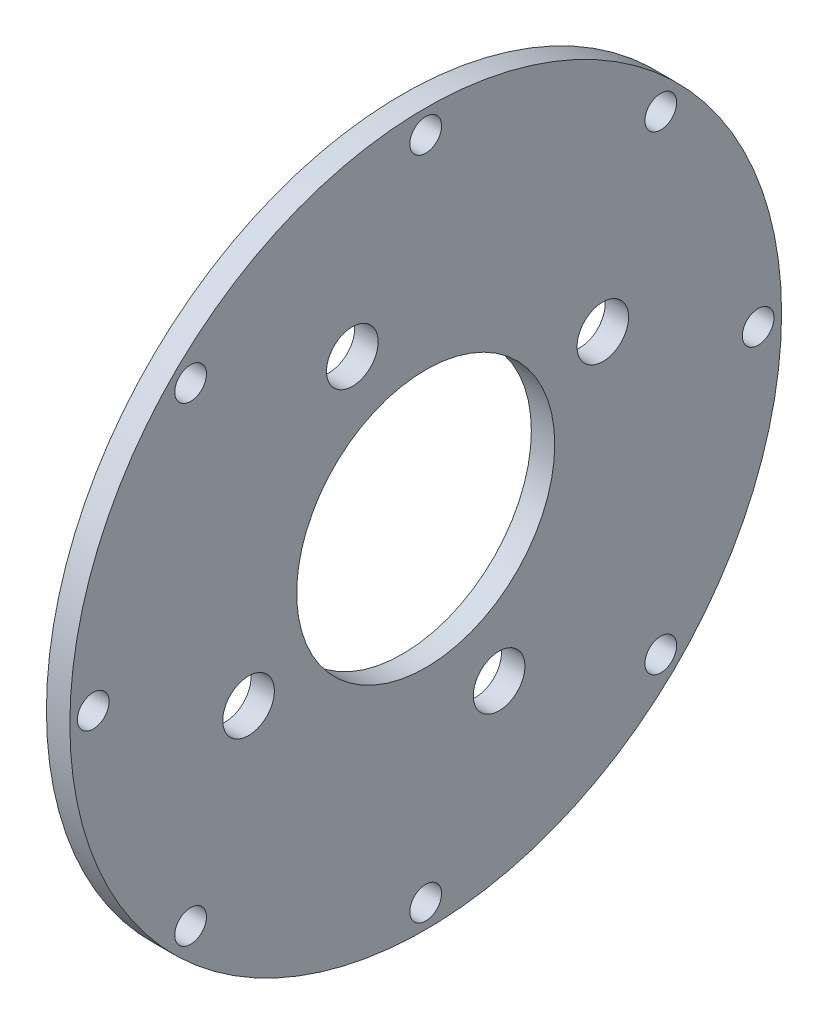
ISO-10303-21;
HEADER;
FILE_DESCRIPTION(('STEP AP214'),'2;1');
FILE_NAME('part.step','',(''),(''),'','','');
FILE_SCHEMA(('AUTOMOTIVE_DESIGN { 1 0 10303 214 1 1 1 1 }'));
ENDSEC;
DATA;
#1=APPLICATION_CONTEXT('core data for automotive mechanical design processes');
#2=APPLICATION_PROTOCOL_DEFINITION('international standard','automotive_design',2000,#1);
#3=PRODUCT_CONTEXT('',#1,'mechanical');
#4=PRODUCT('Part','Part','',(#3));
#5=PRODUCT_RELATED_PRODUCT_CATEGORY('part','',(#4));
#6=PRODUCT_DEFINITION_FORMATION('','',#4);
#7=PRODUCT_DEFINITION_CONTEXT('part definition',#1,'design');
#8=PRODUCT_DEFINITION('design','',#6,#7);
#9=PRODUCT_DEFINITION_SHAPE('','',#8);
#10=(LENGTH_UNIT() NAMED_UNIT(*) SI_UNIT(.MILLI.,.METRE.));
#11=(NAMED_UNIT(*) PLANE_ANGLE_UNIT() SI_UNIT($,.RADIAN.));
#12=(NAMED_UNIT(*) SI_UNIT($,.STERADIAN.) SOLID_ANGLE_UNIT());
#13=UNCERTAINTY_MEASURE_WITH_UNIT(LENGTH_MEASURE(1.E-05),#10,'distance_accuracy_value','');
#14=(GEOMETRIC_REPRESENTATION_CONTEXT(3) GLOBAL_UNCERTAINTY_ASSIGNED_CONTEXT((#13)) GLOBAL_UNIT_ASSIGNED_CONTEXT((#10,
#11,#12)) REPRESENTATION_CONTEXT('',''));
#15=CARTESIAN_POINT('',(0.,0.,0.));
#16=DIRECTION('',(0.,0.,1.));
#17=DIRECTION('',(1.,0.,0.));
#18=AXIS2_PLACEMENT_3D('',#15,#16,#17);
#19=CARTESIAN_POINT('',(3.175,0.,0.));
#20=DIRECTION('',(1.,0.,0.));
#21=DIRECTION('',(0.,0.,-1.));
#22=AXIS2_PLACEMENT_3D('',#19,#20,#21);
#23=PLANE('',#22);
#24=CARTESIAN_POINT('',(3.175,0.,0.));
#25=DIRECTION('',(1.,0.,0.));
#26=DIRECTION('',(0.,0.,-1.));
#27=AXIS2_PLACEMENT_3D('',#24,#25,#26);
#28=CIRCLE('',#27,17.5);
#29=CARTESIAN_POINT('',(3.175,0.,-17.5));
#30=VERTEX_POINT('',#29);
#31=EDGE_CURVE('E106',#30,#30,#28,.T.);
#32=ORIENTED_EDGE('',*,*,#31,.F.);
#33=EDGE_LOOP('',(#32));
#34=FACE_BOUND('',#33,.T.);
#35=CARTESIAN_POINT('',(3.175,-6.59194920871187E-13,45.0849999999993));
#36=DIRECTION('',(1.,0.,0.));
#37=DIRECTION('',(0.,0.,-1.));
#38=AXIS2_PLACEMENT_3D('',#35,#36,#37);
#39=CIRCLE('',#38,2.15264999999998);
#40=CARTESIAN_POINT('',(3.175,-6.59194920871187E-13,42.9323499999993));
#41=VERTEX_POINT('',#40);
#42=EDGE_CURVE('E94',#41,#41,#39,.T.);
#43=ORIENTED_EDGE('',*,*,#42,.F.);
#44=EDGE_LOOP('',(#43));
#45=FACE_BOUND('',#44,.T.);
#46=CARTESIAN_POINT('',(3.175,-45.085,-1.27675647831893E-12));
#47=DIRECTION('',(1.,0.,0.));
#48=DIRECTION('',(0.,0.,-1.));
#49=AXIS2_PLACEMENT_3D('',#46,#47,#48);
#50=CIRCLE('',#49,2.15265000000001);
#51=CARTESIAN_POINT('',(3.175,-45.085,-2.15265000000128));
#52=VERTEX_POINT('',#51);
#53=EDGE_CURVE('E82',#52,#52,#50,.T.);
#54=ORIENTED_EDGE('',*,*,#53,.F.);
#55=EDGE_LOOP('',(#54));
#56=FACE_BOUND('',#55,.T.);
#57=CARTESIAN_POINT('',(3.175,24.0239680756289,9.95038529971896));
#58=DIRECTION('',(1.,0.,0.));
#59=DIRECTION('',(0.,0.,1.));
#60=AXIS2_PLACEMENT_3D('',#57,#58,#59);
#61=CIRCLE('',#60,3.49999999999999);
#62=CARTESIAN_POINT('',(3.175,24.0239680756289,13.4503852997189));
#63=VERTEX_POINT('',#62);
#64=EDGE_CURVE('E70',#63,#63,#61,.T.);
#65=ORIENTED_EDGE('',*,*,#64,.F.);
#66=EDGE_LOOP('',(#65));
#67=FACE_BOUND('',#66,.T.);
#68=CARTESIAN_POINT('',(3.175,-1.59594559789866E-13,-45.085));
#69=DIRECTION('',(1.,0.,0.));
#70=DIRECTION('',(0.,0.,-1.));
#71=AXIS2_PLACEMENT_3D('',#68,#69,#70);
#72=CIRCLE('',#71,2.15265000000001);
#73=CARTESIAN_POINT('',(3.175,-1.59594559789866E-13,-47.23765));
#74=VERTEX_POINT('',#73);
#75=EDGE_CURVE('E58',#74,#74,#72,.T.);
#76=ORIENTED_EDGE('',*,*,#75,.F.);
#77=EDGE_LOOP('',(#76));
#78=FACE_BOUND('',#77,.T.);
#79=CARTESIAN_POINT('',(3.175,-9.95080194897357,24.023795501211));
#80=DIRECTION('',(1.,0.,0.));
#81=DIRECTION('',(0.,0.,-1.));
#82=AXIS2_PLACEMENT_3D('',#79,#80,#81);
#83=CIRCLE('',#82,3.49999999999999);
#84=CARTESIAN_POINT('',(3.175,-9.95080194897357,20.523795501211));
#85=VERTEX_POINT('',#84);
#86=EDGE_CURVE('E46',#85,#85,#83,.T.);
#87=ORIENTED_EDGE('',*,*,#86,.F.);
#88=EDGE_LOOP('',(#87));
#89=FACE_BOUND('',#88,.T.);
#90=CARTESIAN_POINT('',(3.175,0.,0.));
#91=DIRECTION('',(1.,0.,0.));
#92=DIRECTION('',(0.,0.,-1.));
#93=AXIS2_PLACEMENT_3D('',#90,#91,#92);
#94=CIRCLE('',#93,48.26);
#95=CARTESIAN_POINT('',(3.175,0.,-48.26));
#96=VERTEX_POINT('',#95);
#97=EDGE_CURVE('E10',#96,#96,#94,.T.);
#98=ORIENTED_EDGE('',*,*,#97,.T.);
#99=EDGE_LOOP('',(#98));
#100=FACE_BOUND('',#99,.T.);
#101=CARTESIAN_POINT('',(3.175,45.085,0.));
#102=DIRECTION('',(1.,0.,0.));
#103=DIRECTION('',(0.,0.,-1.));
#104=AXIS2_PLACEMENT_3D('',#101,#102,#103);
#105=CIRCLE('',#104,2.15265000000001);
#106=CARTESIAN_POINT('',(3.175,45.085,-2.15265000000001));
#107=VERTEX_POINT('',#106);
#108=EDGE_CURVE('E41',#107,#107,#105,.T.);
#109=ORIENTED_EDGE('',*,*,#108,.F.);
#110=EDGE_LOOP('',(#109));
#111=FACE_BOUND('',#110,.T.);
#112=CARTESIAN_POINT('',(3.175,31.8799092297954,-31.8799092297956));
#113=DIRECTION('',(1.,0.,0.));
#114=DIRECTION('',(0.,0.,-1.));
#115=AXIS2_PLACEMENT_3D('',#112,#113,#114);
#116=CIRCLE('',#115,2.15265000000001);
#117=CARTESIAN_POINT('',(3.175,31.8799092297954,-34.0325592297956));
#118=VERTEX_POINT('',#117);
#119=EDGE_CURVE('E52',#118,#118,#116,.T.);
#120=ORIENTED_EDGE('',*,*,#119,.F.);
#121=EDGE_LOOP('',(#120));
#122=FACE_BOUND('',#121,.T.);
#123=CARTESIAN_POINT('',(3.175,9.94801274798736,-24.0182399849756));
#124=DIRECTION('',(1.,0.,0.));
#125=DIRECTION('',(0.,0.,-1.));
#126=AXIS2_PLACEMENT_3D('',#123,#124,#125);
#127=CIRCLE('',#126,3.50000000000001);
#128=CARTESIAN_POINT('',(3.175,9.94801274798736,-27.5182399849756));
#129=VERTEX_POINT('',#128);
#130=EDGE_CURVE('E64',#129,#129,#127,.T.);
#131=ORIENTED_EDGE('',*,*,#130,.F.);
#132=EDGE_LOOP('',(#131));
#133=FACE_BOUND('',#132,.T.);
#134=CARTESIAN_POINT('',(3.175,-31.879909229795,-31.8799092297966));
#135=DIRECTION('',(1.,0.,0.));
#136=DIRECTION('',(0.,0.,-1.));
#137=AXIS2_PLACEMENT_3D('',#134,#135,#136);
#138=CIRCLE('',#137,2.15264999999998);
#139=CARTESIAN_POINT('',(3.175,-31.879909229795,-34.0325592297966));
#140=VERTEX_POINT('',#139);
#141=EDGE_CURVE('E76',#140,#140,#138,.T.);
#142=ORIENTED_EDGE('',*,*,#141,.F.);
#143=EDGE_LOOP('',(#142));
#144=FACE_BOUND('',#143,.T.);
#145=CARTESIAN_POINT('',(3.175,-31.879909229796,31.8799092297944));
#146=DIRECTION('',(1.,0.,0.));
#147=DIRECTION('',(0.,0.,-1.));
#148=AXIS2_PLACEMENT_3D('',#145,#146,#147);
#149=CIRCLE('',#148,2.15264999999998);
#150=CARTESIAN_POINT('',(3.175,-31.879909229796,29.7272592297944));
#151=VERTEX_POINT('',#150);
#152=EDGE_CURVE('E88',#151,#151,#149,.T.);
#153=ORIENTED_EDGE('',*,*,#152,.F.);
#154=EDGE_LOOP('',(#153));
#155=FACE_BOUND('',#154,.T.);
#156=CARTESIAN_POINT('',(3.175,31.8799092297959,31.8799092297951));
#157=DIRECTION('',(1.,0.,0.));
#158=DIRECTION('',(0.,0.,-1.));
#159=AXIS2_PLACEMENT_3D('',#156,#157,#158);
#160=CIRCLE('',#159,2.15264999999998);
#161=CARTESIAN_POINT('',(3.175,31.8799092297959,29.7272592297951));
#162=VERTEX_POINT('',#161);
#163=EDGE_CURVE('E100',#162,#162,#160,.T.);
#164=ORIENTED_EDGE('',*,*,#163,.F.);
#165=EDGE_LOOP('',(#164));
#166=FACE_BOUND('',#165,.T.);
#167=CARTESIAN_POINT('',(3.175,-24.0242121504657,-9.95097452339145));
#168=DIRECTION('',(1.,0.,0.));
#169=DIRECTION('',(0.,0.,-1.));
#170=AXIS2_PLACEMENT_3D('',#167,#168,#169);
#171=CIRCLE('',#170,3.49999999999999);
#172=CARTESIAN_POINT('',(3.175,-24.0242121504657,-13.4509745233914));
#173=VERTEX_POINT('',#172);
#174=EDGE_CURVE('E112',#173,#173,#171,.T.);
#175=ORIENTED_EDGE('',*,*,#174,.F.);
#176=EDGE_LOOP('',(#175));
#177=FACE_BOUND('',#176,.T.);
#178=ADVANCED_FACE('F30',(#34,#45,#56,#67,#78,#89,#100,#111,#122,#133,#144,#155,#166,#177),#23,.T.);
#179=CARTESIAN_POINT('',(0.,0.,0.));
#180=DIRECTION('',(1.,0.,0.));
#181=DIRECTION('',(0.,0.,-1.));
#182=AXIS2_PLACEMENT_3D('',#179,#180,#181);
#183=PLANE('',#182);
#184=CARTESIAN_POINT('',(0.,0.,0.));
#185=DIRECTION('',(1.,0.,0.));
#186=DIRECTION('',(0.,0.,-1.));
#187=AXIS2_PLACEMENT_3D('',#184,#185,#186);
#188=CIRCLE('',#187,17.5);
#189=CARTESIAN_POINT('',(0.,0.,-17.5));
#190=VERTEX_POINT('',#189);
#191=EDGE_CURVE('E109',#190,#190,#188,.T.);
#192=ORIENTED_EDGE('',*,*,#191,.T.);
#193=EDGE_LOOP('',(#192));
#194=FACE_BOUND('',#193,.T.);
#195=CARTESIAN_POINT('',(0.,-6.59194920871187E-13,45.0849999999993));
#196=DIRECTION('',(1.,0.,0.));
#197=DIRECTION('',(0.,0.,-1.));
#198=AXIS2_PLACEMENT_3D('',#195,#196,#197);
#199=CIRCLE('',#198,2.15264999999998);
#200=CARTESIAN_POINT('',(0.,-6.59194920871187E-13,42.9323499999993));
#201=VERTEX_POINT('',#200);
#202=EDGE_CURVE('E97',#201,#201,#199,.T.);
#203=ORIENTED_EDGE('',*,*,#202,.T.);
#204=EDGE_LOOP('',(#203));
#205=FACE_BOUND('',#204,.T.);
#206=CARTESIAN_POINT('',(0.,-45.085,-1.27675647831893E-12));
#207=DIRECTION('',(1.,0.,0.));
#208=DIRECTION('',(0.,0.,-1.));
#209=AXIS2_PLACEMENT_3D('',#206,#207,#208);
#210=CIRCLE('',#209,2.15265000000001);
#211=CARTESIAN_POINT('',(0.,-45.085,-2.15265000000128));
#212=VERTEX_POINT('',#211);
#213=EDGE_CURVE('E85',#212,#212,#210,.T.);
#214=ORIENTED_EDGE('',*,*,#213,.T.);
#215=EDGE_LOOP('',(#214));
#216=FACE_BOUND('',#215,.T.);
#217=CARTESIAN_POINT('',(0.,24.0239680756289,9.95038529971896));
#218=DIRECTION('',(1.,0.,0.));
#219=DIRECTION('',(0.,0.,1.));
#220=AXIS2_PLACEMENT_3D('',#217,#218,#219);
#221=CIRCLE('',#220,3.49999999999999);
#222=CARTESIAN_POINT('',(0.,24.0239680756289,13.4503852997189));
#223=VERTEX_POINT('',#222);
#224=EDGE_CURVE('E73',#223,#223,#221,.T.);
#225=ORIENTED_EDGE('',*,*,#224,.T.);
#226=EDGE_LOOP('',(#225));
#227=FACE_BOUND('',#226,.T.);
#228=CARTESIAN_POINT('',(0.,-1.59594559789866E-13,-45.085));
#229=DIRECTION('',(1.,0.,0.));
#230=DIRECTION('',(0.,0.,-1.));
#231=AXIS2_PLACEMENT_3D('',#228,#229,#230);
#232=CIRCLE('',#231,2.15265000000001);
#233=CARTESIAN_POINT('',(0.,-1.59594559789866E-13,-47.23765));
#234=VERTEX_POINT('',#233);
#235=EDGE_CURVE('E61',#234,#234,#232,.T.);
#236=ORIENTED_EDGE('',*,*,#235,.T.);
#237=EDGE_LOOP('',(#236));
#238=FACE_BOUND('',#237,.T.);
#239=CARTESIAN_POINT('',(0.,-9.95080194897357,24.023795501211));
#240=DIRECTION('',(1.,0.,0.));
#241=DIRECTION('',(0.,0.,-1.));
#242=AXIS2_PLACEMENT_3D('',#239,#240,#241);
#243=CIRCLE('',#242,3.49999999999999);
#244=CARTESIAN_POINT('',(0.,-9.95080194897357,20.523795501211));
#245=VERTEX_POINT('',#244);
#246=EDGE_CURVE('E49',#245,#245,#243,.T.);
#247=ORIENTED_EDGE('',*,*,#246,.T.);
#248=EDGE_LOOP('',(#247));
#249=FACE_BOUND('',#248,.T.);
#250=CARTESIAN_POINT('',(0.,0.,0.));
#251=DIRECTION('',(1.,0.,0.));
#252=DIRECTION('',(0.,0.,-1.));
#253=AXIS2_PLACEMENT_3D('',#250,#251,#252);
#254=CIRCLE('',#253,48.26);
#255=CARTESIAN_POINT('',(0.,0.,-48.26));
#256=VERTEX_POINT('',#255);
#257=EDGE_CURVE('E34',#256,#256,#254,.T.);
#258=ORIENTED_EDGE('',*,*,#257,.F.);
#259=EDGE_LOOP('',(#258));
#260=FACE_BOUND('',#259,.T.);
#261=CARTESIAN_POINT('',(0.,45.085,0.));
#262=DIRECTION('',(1.,0.,0.));
#263=DIRECTION('',(0.,0.,-1.));
#264=AXIS2_PLACEMENT_3D('',#261,#262,#263);
#265=CIRCLE('',#264,2.15265000000001);
#266=CARTESIAN_POINT('',(0.,45.085,-2.15265000000001));
#267=VERTEX_POINT('',#266);
#268=EDGE_CURVE('E43',#267,#267,#265,.T.);
#269=ORIENTED_EDGE('',*,*,#268,.T.);
#270=EDGE_LOOP('',(#269));
#271=FACE_BOUND('',#270,.T.);
#272=CARTESIAN_POINT('',(0.,31.8799092297954,-31.8799092297956));
#273=DIRECTION('',(1.,0.,0.));
#274=DIRECTION('',(0.,0.,-1.));
#275=AXIS2_PLACEMENT_3D('',#272,#273,#274);
#276=CIRCLE('',#275,2.15265000000001);
#277=CARTESIAN_POINT('',(0.,31.8799092297954,-34.0325592297956));
#278=VERTEX_POINT('',#277);
#279=EDGE_CURVE('E55',#278,#278,#276,.T.);
#280=ORIENTED_EDGE('',*,*,#279,.T.);
#281=EDGE_LOOP('',(#280));
#282=FACE_BOUND('',#281,.T.);
#283=CARTESIAN_POINT('',(0.,9.94801274798736,-24.0182399849756));
#284=DIRECTION('',(1.,0.,0.));
#285=DIRECTION('',(0.,0.,-1.));
#286=AXIS2_PLACEMENT_3D('',#283,#284,#285);
#287=CIRCLE('',#286,3.50000000000001);
#288=CARTESIAN_POINT('',(0.,9.94801274798736,-27.5182399849756));
#289=VERTEX_POINT('',#288);
#290=EDGE_CURVE('E67',#289,#289,#287,.T.);
#291=ORIENTED_EDGE('',*,*,#290,.T.);
#292=EDGE_LOOP('',(#291));
#293=FACE_BOUND('',#292,.T.);
#294=CARTESIAN_POINT('',(0.,-31.879909229795,-31.8799092297966));
#295=DIRECTION('',(1.,0.,0.));
#296=DIRECTION('',(0.,0.,-1.));
#297=AXIS2_PLACEMENT_3D('',#294,#295,#296);
#298=CIRCLE('',#297,2.15264999999998);
#299=CARTESIAN_POINT('',(0.,-31.879909229795,-34.0325592297966));
#300=VERTEX_POINT('',#299);
#301=EDGE_CURVE('E79',#300,#300,#298,.T.);
#302=ORIENTED_EDGE('',*,*,#301,.T.);
#303=EDGE_LOOP('',(#302));
#304=FACE_BOUND('',#303,.T.);
#305=CARTESIAN_POINT('',(0.,-31.879909229796,31.8799092297944));
#306=DIRECTION('',(1.,0.,0.));
#307=DIRECTION('',(0.,0.,-1.));
#308=AXIS2_PLACEMENT_3D('',#305,#306,#307);
#309=CIRCLE('',#308,2.15264999999998);
#310=CARTESIAN_POINT('',(0.,-31.879909229796,29.7272592297944));
#311=VERTEX_POINT('',#310);
#312=EDGE_CURVE('E91',#311,#311,#309,.T.);
#313=ORIENTED_EDGE('',*,*,#312,.T.);
#314=EDGE_LOOP('',(#313));
#315=FACE_BOUND('',#314,.T.);
#316=CARTESIAN_POINT('',(0.,31.8799092297959,31.8799092297951));
#317=DIRECTION('',(1.,0.,0.));
#318=DIRECTION('',(0.,0.,-1.));
#319=AXIS2_PLACEMENT_3D('',#316,#317,#318);
#320=CIRCLE('',#319,2.15264999999998);
#321=CARTESIAN_POINT('',(0.,31.8799092297959,29.7272592297951));
#322=VERTEX_POINT('',#321);
#323=EDGE_CURVE('E103',#322,#322,#320,.T.);
#324=ORIENTED_EDGE('',*,*,#323,.T.);
#325=EDGE_LOOP('',(#324));
#326=FACE_BOUND('',#325,.T.);
#327=CARTESIAN_POINT('',(0.,-24.0242121504657,-9.95097452339145));
#328=DIRECTION('',(1.,0.,0.));
#329=DIRECTION('',(0.,0.,-1.));
#330=AXIS2_PLACEMENT_3D('',#327,#328,#329);
#331=CIRCLE('',#330,3.49999999999999);
#332=CARTESIAN_POINT('',(0.,-24.0242121504657,-13.4509745233914));
#333=VERTEX_POINT('',#332);
#334=EDGE_CURVE('E115',#333,#333,#331,.T.);
#335=ORIENTED_EDGE('',*,*,#334,.T.);
#336=EDGE_LOOP('',(#335));
#337=FACE_BOUND('',#336,.T.);
#338=ADVANCED_FACE('F125',(#194,#205,#216,#227,#238,#249,#260,#271,#282,#293,#304,#315,#326,
#337),#183,.F.);
#339=CARTESIAN_POINT('',(3.175,0.,0.));
#340=DIRECTION('',(-1.,0.,0.));
#341=DIRECTION('',(0.,0.,1.));
#342=AXIS2_PLACEMENT_3D('',#339,#340,#341);
#343=CYLINDRICAL_SURFACE('',#342,48.26);
#344=ORIENTED_EDGE('',*,*,#97,.F.);
#345=EDGE_LOOP('',(#344));
#346=FACE_BOUND('',#345,.T.);
#347=ORIENTED_EDGE('',*,*,#257,.T.);
#348=EDGE_LOOP('',(#347));
#349=FACE_BOUND('',#348,.T.);
#350=ADVANCED_FACE('F32',(#346,#349),#343,.T.);
#351=CARTESIAN_POINT('',(3.175,45.085,0.));
#352=DIRECTION('',(-1.,0.,0.));
#353=DIRECTION('',(0.,0.,1.));
#354=AXIS2_PLACEMENT_3D('',#351,#352,#353);
#355=CYLINDRICAL_SURFACE('',#354,2.15265000000001);
#356=ORIENTED_EDGE('',*,*,#108,.T.);
#357=EDGE_LOOP('',(#356));
#358=FACE_BOUND('',#357,.T.);
#359=ORIENTED_EDGE('',*,*,#268,.F.);
#360=EDGE_LOOP('',(#359));
#361=FACE_BOUND('',#360,.T.);
#362=ADVANCED_FACE('F135',(#358,#361),#355,.F.);
#363=CARTESIAN_POINT('',(3.175,-9.95080194897357,24.023795501211));
#364=DIRECTION('',(-1.,0.,0.));
#365=DIRECTION('',(0.,0.,1.));
#366=AXIS2_PLACEMENT_3D('',#363,#364,#365);
#367=CYLINDRICAL_SURFACE('',#366,3.49999999999999);
#368=ORIENTED_EDGE('',*,*,#86,.T.);
#369=EDGE_LOOP('',(#368));
#370=FACE_BOUND('',#369,.T.);
#371=ORIENTED_EDGE('',*,*,#246,.F.);
#372=EDGE_LOOP('',(#371));
#373=FACE_BOUND('',#372,.T.);
#374=ADVANCED_FACE('F138',(#370,#373),#367,.F.);
#375=CARTESIAN_POINT('',(3.175,31.8799092297954,-31.8799092297956));
#376=DIRECTION('',(-1.,0.,0.));
#377=DIRECTION('',(0.,0.,1.));
#378=AXIS2_PLACEMENT_3D('',#375,#376,#377);
#379=CYLINDRICAL_SURFACE('',#378,2.15265000000001);
#380=ORIENTED_EDGE('',*,*,#119,.T.);
#381=EDGE_LOOP('',(#380));
#382=FACE_BOUND('',#381,.T.);
#383=ORIENTED_EDGE('',*,*,#279,.F.);
#384=EDGE_LOOP('',(#383));
#385=FACE_BOUND('',#384,.T.);
#386=ADVANCED_FACE('F142',(#382,#385),#379,.F.);
#387=CARTESIAN_POINT('',(3.175,-1.59594559789866E-13,-45.085));
#388=DIRECTION('',(-1.,0.,0.));
#389=DIRECTION('',(0.,0.,1.));
#390=AXIS2_PLACEMENT_3D('',#387,#388,#389);
#391=CYLINDRICAL_SURFACE('',#390,2.15265000000001);
#392=ORIENTED_EDGE('',*,*,#75,.T.);
#393=EDGE_LOOP('',(#392));
#394=FACE_BOUND('',#393,.T.);
#395=ORIENTED_EDGE('',*,*,#235,.F.);
#396=EDGE_LOOP('',(#395));
#397=FACE_BOUND('',#396,.T.);
#398=ADVANCED_FACE('F146',(#394,#397),#391,.F.);
#399=CARTESIAN_POINT('',(3.175,9.94801274798736,-24.0182399849756));
#400=DIRECTION('',(-1.,0.,0.));
#401=DIRECTION('',(0.,0.,1.));
#402=AXIS2_PLACEMENT_3D('',#399,#400,#401);
#403=CYLINDRICAL_SURFACE('',#402,3.50000000000001);
#404=ORIENTED_EDGE('',*,*,#130,.T.);
#405=EDGE_LOOP('',(#404));
#406=FACE_BOUND('',#405,.T.);
#407=ORIENTED_EDGE('',*,*,#290,.F.);
#408=EDGE_LOOP('',(#407));
#409=FACE_BOUND('',#408,.T.);
#410=ADVANCED_FACE('F150',(#406,#409),#403,.F.);
#411=CARTESIAN_POINT('',(3.175,24.0239680756289,9.95038529971896));
#412=DIRECTION('',(-1.,0.,0.));
#413=DIRECTION('',(0.,0.,1.));
#414=AXIS2_PLACEMENT_3D('',#411,#412,#413);
#415=CYLINDRICAL_SURFACE('',#414,3.49999999999999);
#416=ORIENTED_EDGE('',*,*,#64,.T.);
#417=EDGE_LOOP('',(#416));
#418=FACE_BOUND('',#417,.T.);
#419=ORIENTED_EDGE('',*,*,#224,.F.);
#420=EDGE_LOOP('',(#419));
#421=FACE_BOUND('',#420,.T.);
#422=ADVANCED_FACE('F154',(#418,#421),#415,.F.);
#423=CARTESIAN_POINT('',(3.175,-31.879909229795,-31.8799092297966));
#424=DIRECTION('',(-1.,0.,0.));
#425=DIRECTION('',(0.,0.,1.));
#426=AXIS2_PLACEMENT_3D('',#423,#424,#425);
#427=CYLINDRICAL_SURFACE('',#426,2.15264999999998);
#428=ORIENTED_EDGE('',*,*,#141,.T.);
#429=EDGE_LOOP('',(#428));
#430=FACE_BOUND('',#429,.T.);
#431=ORIENTED_EDGE('',*,*,#301,.F.);
#432=EDGE_LOOP('',(#431));
#433=FACE_BOUND('',#432,.T.);
#434=ADVANCED_FACE('F158',(#430,#433),#427,.F.);
#435=CARTESIAN_POINT('',(3.175,-45.085,-1.27675647831893E-12));
#436=DIRECTION('',(-1.,0.,0.));
#437=DIRECTION('',(0.,0.,1.));
#438=AXIS2_PLACEMENT_3D('',#435,#436,#437);
#439=CYLINDRICAL_SURFACE('',#438,2.15265000000001);
#440=ORIENTED_EDGE('',*,*,#53,.T.);
#441=EDGE_LOOP('',(#440));
#442=FACE_BOUND('',#441,.T.);
#443=ORIENTED_EDGE('',*,*,#213,.F.);
#444=EDGE_LOOP('',(#443));
#445=FACE_BOUND('',#444,.T.);
#446=ADVANCED_FACE('F162',(#442,#445),#439,.F.);
#447=CARTESIAN_POINT('',(3.175,-31.879909229796,31.8799092297944));
#448=DIRECTION('',(-1.,0.,0.));
#449=DIRECTION('',(0.,0.,1.));
#450=AXIS2_PLACEMENT_3D('',#447,#448,#449);
#451=CYLINDRICAL_SURFACE('',#450,2.15264999999998);
#452=ORIENTED_EDGE('',*,*,#152,.T.);
#453=EDGE_LOOP('',(#452));
#454=FACE_BOUND('',#453,.T.);
#455=ORIENTED_EDGE('',*,*,#312,.F.);
#456=EDGE_LOOP('',(#455));
#457=FACE_BOUND('',#456,.T.);
#458=ADVANCED_FACE('F166',(#454,#457),#451,.F.);
#459=CARTESIAN_POINT('',(3.175,-6.59194920871187E-13,45.0849999999993));
#460=DIRECTION('',(-1.,0.,0.));
#461=DIRECTION('',(0.,0.,1.));
#462=AXIS2_PLACEMENT_3D('',#459,#460,#461);
#463=CYLINDRICAL_SURFACE('',#462,2.15264999999998);
#464=ORIENTED_EDGE('',*,*,#42,.T.);
#465=EDGE_LOOP('',(#464));
#466=FACE_BOUND('',#465,.T.);
#467=ORIENTED_EDGE('',*,*,#202,.F.);
#468=EDGE_LOOP('',(#467));
#469=FACE_BOUND('',#468,.T.);
#470=ADVANCED_FACE('F170',(#466,#469),#463,.F.);
#471=CARTESIAN_POINT('',(3.175,31.8799092297959,31.8799092297951));
#472=DIRECTION('',(-1.,0.,0.));
#473=DIRECTION('',(0.,0.,1.));
#474=AXIS2_PLACEMENT_3D('',#471,#472,#473);
#475=CYLINDRICAL_SURFACE('',#474,2.15264999999998);
#476=ORIENTED_EDGE('',*,*,#163,.T.);
#477=EDGE_LOOP('',(#476));
#478=FACE_BOUND('',#477,.T.);
#479=ORIENTED_EDGE('',*,*,#323,.F.);
#480=EDGE_LOOP('',(#479));
#481=FACE_BOUND('',#480,.T.);
#482=ADVANCED_FACE('F174',(#478,#481),#475,.F.);
#483=CARTESIAN_POINT('',(3.175,0.,0.));
#484=DIRECTION('',(-1.,0.,0.));
#485=DIRECTION('',(0.,0.,1.));
#486=AXIS2_PLACEMENT_3D('',#483,#484,#485);
#487=CYLINDRICAL_SURFACE('',#486,17.5);
#488=ORIENTED_EDGE('',*,*,#31,.T.);
#489=EDGE_LOOP('',(#488));
#490=FACE_BOUND('',#489,.T.);
#491=ORIENTED_EDGE('',*,*,#191,.F.);
#492=EDGE_LOOP('',(#491));
#493=FACE_BOUND('',#492,.T.);
#494=ADVANCED_FACE('F178',(#490,#493),#487,.F.);
#495=CARTESIAN_POINT('',(3.175,-24.0242121504657,-9.95097452339145));
#496=DIRECTION('',(-1.,0.,0.));
#497=DIRECTION('',(0.,0.,1.));
#498=AXIS2_PLACEMENT_3D('',#495,#496,#497);
#499=CYLINDRICAL_SURFACE('',#498,3.49999999999999);
#500=ORIENTED_EDGE('',*,*,#174,.T.);
#501=EDGE_LOOP('',(#500));
#502=FACE_BOUND('',#501,.T.);
#503=ORIENTED_EDGE('',*,*,#334,.F.);
#504=EDGE_LOOP('',(#503));
#505=FACE_BOUND('',#504,.T.);
#506=ADVANCED_FACE('F121',(#502,#505),#499,.F.);
#507=CLOSED_SHELL('',(#178,#338,#350,#362,#374,#386,#398,#410,#422,#434,#446,#458,#470,#482,
#494,#506));
#508=MANIFOLD_SOLID_BREP('B2',#507);
#509=ADVANCED_BREP_SHAPE_REPRESENTATION('',(#18,#508),#14);
#510=SHAPE_DEFINITION_REPRESENTATION(#9,#509);
ENDSEC;
END-ISO-10303-21;
